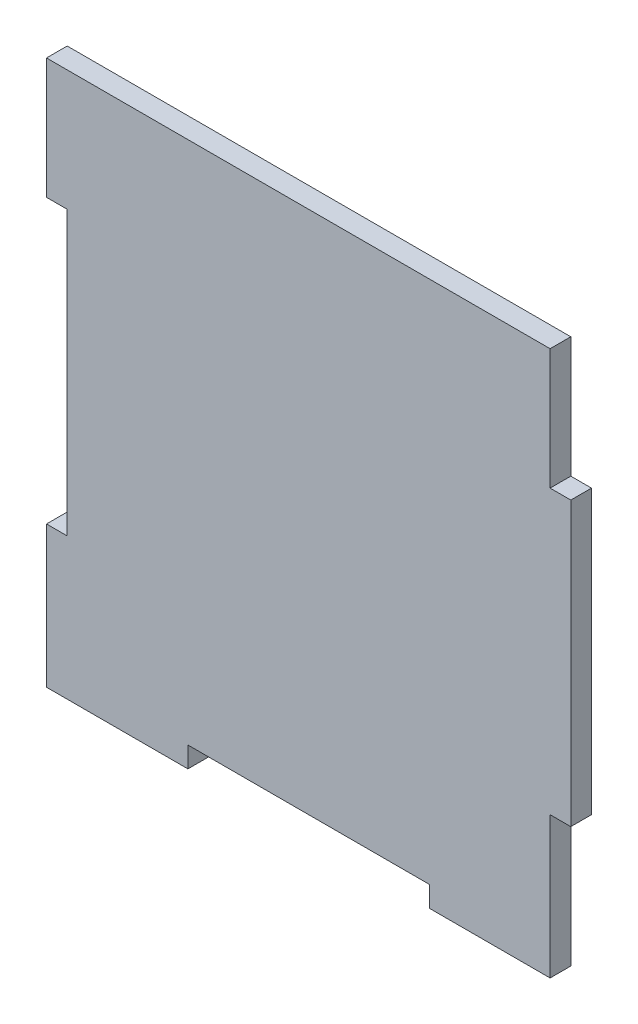
ISO-10303-21;
HEADER;
FILE_DESCRIPTION(('STEP AP214'),'2;1');
FILE_NAME('part.step','',(''),(''),'','','');
FILE_SCHEMA(('AUTOMOTIVE_DESIGN { 1 0 10303 214 1 1 1 1 }'));
ENDSEC;
DATA;
#1=APPLICATION_CONTEXT('core data for automotive mechanical design processes');
#2=APPLICATION_PROTOCOL_DEFINITION('international standard','automotive_design',2000,#1);
#3=PRODUCT_CONTEXT('',#1,'mechanical');
#4=PRODUCT('Part','Part','',(#3));
#5=PRODUCT_RELATED_PRODUCT_CATEGORY('part','',(#4));
#6=PRODUCT_DEFINITION_FORMATION('','',#4);
#7=PRODUCT_DEFINITION_CONTEXT('part definition',#1,'design');
#8=PRODUCT_DEFINITION('design','',#6,#7);
#9=PRODUCT_DEFINITION_SHAPE('','',#8);
#10=(LENGTH_UNIT() NAMED_UNIT(*) SI_UNIT(.MILLI.,.METRE.));
#11=(NAMED_UNIT(*) PLANE_ANGLE_UNIT() SI_UNIT($,.RADIAN.));
#12=(NAMED_UNIT(*) SI_UNIT($,.STERADIAN.) SOLID_ANGLE_UNIT());
#13=UNCERTAINTY_MEASURE_WITH_UNIT(LENGTH_MEASURE(1.E-05),#10,'distance_accuracy_value','');
#14=(GEOMETRIC_REPRESENTATION_CONTEXT(3) GLOBAL_UNCERTAINTY_ASSIGNED_CONTEXT((#13)) GLOBAL_UNIT_ASSIGNED_CONTEXT((#10,
#11,#12)) REPRESENTATION_CONTEXT('',''));
#15=CARTESIAN_POINT('',(0.,0.,0.));
#16=DIRECTION('',(0.,0.,1.));
#17=DIRECTION('',(1.,0.,0.));
#18=AXIS2_PLACEMENT_3D('',#15,#16,#17);
#19=CARTESIAN_POINT('',(35.,-20.5,3.));
#20=DIRECTION('',(0.,1.,0.));
#21=DIRECTION('',(-1.,0.,0.));
#22=AXIS2_PLACEMENT_3D('',#19,#20,#21);
#23=PLANE('',#22);
#24=DIRECTION('',(1.,0.,0.));
#25=VECTOR('',#24,1.);
#26=CARTESIAN_POINT('',(35.,-20.5,0.));
#27=LINE('',#26,#25);
#28=CARTESIAN_POINT('',(35.,-20.5,0.));
#29=VERTEX_POINT('',#28);
#30=CARTESIAN_POINT('',(38.,-20.5,0.));
#31=VERTEX_POINT('',#30);
#32=EDGE_CURVE('E192',#29,#31,#27,.T.);
#33=ORIENTED_EDGE('',*,*,#32,.T.);
#34=DIRECTION('',(0.,0.,-1.));
#35=VECTOR('',#34,1.);
#36=CARTESIAN_POINT('',(38.,-20.5,3.));
#37=LINE('',#36,#35);
#38=CARTESIAN_POINT('',(38.,-20.5,3.));
#39=VERTEX_POINT('',#38);
#40=EDGE_CURVE('E48',#39,#31,#37,.T.);
#41=ORIENTED_EDGE('',*,*,#40,.F.);
#42=DIRECTION('',(1.,0.,0.));
#43=VECTOR('',#42,1.);
#44=CARTESIAN_POINT('',(35.,-20.5,3.));
#45=LINE('',#44,#43);
#46=CARTESIAN_POINT('',(35.,-20.5,3.));
#47=VERTEX_POINT('',#46);
#48=EDGE_CURVE('E124',#47,#39,#45,.T.);
#49=ORIENTED_EDGE('',*,*,#48,.F.);
#50=DIRECTION('',(0.,0.,-1.));
#51=VECTOR('',#50,1.);
#52=CARTESIAN_POINT('',(35.,-20.5,3.));
#53=LINE('',#52,#51);
#54=EDGE_CURVE('E11',#47,#29,#53,.T.);
#55=ORIENTED_EDGE('',*,*,#54,.T.);
#56=EDGE_LOOP('',(#33,#41,#49,#55));
#57=FACE_BOUND('',#56,.T.);
#58=ADVANCED_FACE('F39',(#57),#23,.F.);
#59=CARTESIAN_POINT('',(38.,20.5,3.));
#60=DIRECTION('',(-1.,0.,0.));
#61=DIRECTION('',(0.,0.,1.));
#62=AXIS2_PLACEMENT_3D('',#59,#60,#61);
#63=PLANE('',#62);
#64=DIRECTION('',(0.,1.,0.));
#65=VECTOR('',#64,1.);
#66=CARTESIAN_POINT('',(38.,20.5,0.));
#67=LINE('',#66,#65);
#68=CARTESIAN_POINT('',(38.,20.5,0.));
#69=VERTEX_POINT('',#68);
#70=EDGE_CURVE('E195',#31,#69,#67,.T.);
#71=ORIENTED_EDGE('',*,*,#70,.T.);
#72=DIRECTION('',(0.,0.,-1.));
#73=VECTOR('',#72,1.);
#74=CARTESIAN_POINT('',(38.,20.5,3.));
#75=LINE('',#74,#73);
#76=CARTESIAN_POINT('',(38.,20.5,3.));
#77=VERTEX_POINT('',#76);
#78=EDGE_CURVE('E282',#77,#69,#75,.T.);
#79=ORIENTED_EDGE('',*,*,#78,.F.);
#80=DIRECTION('',(0.,1.,0.));
#81=VECTOR('',#80,1.);
#82=CARTESIAN_POINT('',(38.,20.5,3.));
#83=LINE('',#82,#81);
#84=EDGE_CURVE('E292',#39,#77,#83,.T.);
#85=ORIENTED_EDGE('',*,*,#84,.F.);
#86=ORIENTED_EDGE('',*,*,#40,.T.);
#87=EDGE_LOOP('',(#71,#79,#85,#86));
#88=FACE_BOUND('',#87,.T.);
#89=ADVANCED_FACE('F290',(#88),#63,.F.);
#90=CARTESIAN_POINT('',(35.,20.5,3.));
#91=DIRECTION('',(0.,-1.,0.));
#92=DIRECTION('',(1.,0.,0.));
#93=AXIS2_PLACEMENT_3D('',#90,#91,#92);
#94=PLANE('',#93);
#95=DIRECTION('',(-1.,0.,0.));
#96=VECTOR('',#95,1.);
#97=CARTESIAN_POINT('',(35.,20.5,0.));
#98=LINE('',#97,#96);
#99=CARTESIAN_POINT('',(35.,20.5,0.));
#100=VERTEX_POINT('',#99);
#101=EDGE_CURVE('E198',#69,#100,#98,.T.);
#102=ORIENTED_EDGE('',*,*,#101,.T.);
#103=DIRECTION('',(0.,0.,-1.));
#104=VECTOR('',#103,1.);
#105=CARTESIAN_POINT('',(35.,20.5,3.));
#106=LINE('',#105,#104);
#107=CARTESIAN_POINT('',(35.,20.5,3.));
#108=VERTEX_POINT('',#107);
#109=EDGE_CURVE('E278',#108,#100,#106,.T.);
#110=ORIENTED_EDGE('',*,*,#109,.F.);
#111=DIRECTION('',(-1.,0.,0.));
#112=VECTOR('',#111,1.);
#113=CARTESIAN_POINT('',(35.,20.5,3.));
#114=LINE('',#113,#112);
#115=EDGE_CURVE('E311',#77,#108,#114,.T.);
#116=ORIENTED_EDGE('',*,*,#115,.F.);
#117=ORIENTED_EDGE('',*,*,#78,.T.);
#118=EDGE_LOOP('',(#102,#110,#116,#117));
#119=FACE_BOUND('',#118,.T.);
#120=ADVANCED_FACE('F301',(#119),#94,.F.);
#121=CARTESIAN_POINT('',(35.,38.,3.));
#122=DIRECTION('',(-1.,0.,0.));
#123=DIRECTION('',(0.,-1.,0.));
#124=AXIS2_PLACEMENT_3D('',#121,#122,#123);
#125=PLANE('',#124);
#126=DIRECTION('',(0.,1.,0.));
#127=VECTOR('',#126,1.);
#128=CARTESIAN_POINT('',(35.,38.,0.));
#129=LINE('',#128,#127);
#130=CARTESIAN_POINT('',(35.,38.,0.));
#131=VERTEX_POINT('',#130);
#132=EDGE_CURVE('E201',#100,#131,#129,.T.);
#133=ORIENTED_EDGE('',*,*,#132,.T.);
#134=DIRECTION('',(0.,0.,-1.));
#135=VECTOR('',#134,1.);
#136=CARTESIAN_POINT('',(35.,38.,3.));
#137=LINE('',#136,#135);
#138=CARTESIAN_POINT('',(35.,38.,3.));
#139=VERTEX_POINT('',#138);
#140=EDGE_CURVE('E274',#139,#131,#137,.T.);
#141=ORIENTED_EDGE('',*,*,#140,.F.);
#142=DIRECTION('',(0.,1.,0.));
#143=VECTOR('',#142,1.);
#144=CARTESIAN_POINT('',(35.,38.,3.));
#145=LINE('',#144,#143);
#146=EDGE_CURVE('E307',#108,#139,#145,.T.);
#147=ORIENTED_EDGE('',*,*,#146,.F.);
#148=ORIENTED_EDGE('',*,*,#109,.T.);
#149=EDGE_LOOP('',(#133,#141,#147,#148));
#150=FACE_BOUND('',#149,.T.);
#151=ADVANCED_FACE('F305',(#150),#125,.F.);
#152=CARTESIAN_POINT('',(-38.,38.,3.));
#153=DIRECTION('',(0.,-1.,0.));
#154=DIRECTION('',(0.,0.,-1.));
#155=AXIS2_PLACEMENT_3D('',#152,#153,#154);
#156=PLANE('',#155);
#157=DIRECTION('',(-1.,0.,0.));
#158=VECTOR('',#157,1.);
#159=CARTESIAN_POINT('',(-38.,38.,0.));
#160=LINE('',#159,#158);
#161=CARTESIAN_POINT('',(-38.,38.,0.));
#162=VERTEX_POINT('',#161);
#163=EDGE_CURVE('E205',#131,#162,#160,.T.);
#164=ORIENTED_EDGE('',*,*,#163,.T.);
#165=DIRECTION('',(0.,0.,-1.));
#166=VECTOR('',#165,1.);
#167=CARTESIAN_POINT('',(-38.,38.,3.));
#168=LINE('',#167,#166);
#169=CARTESIAN_POINT('',(-38.,38.,3.));
#170=VERTEX_POINT('',#169);
#171=EDGE_CURVE('E270',#170,#162,#168,.T.);
#172=ORIENTED_EDGE('',*,*,#171,.F.);
#173=DIRECTION('',(-1.,0.,0.));
#174=VECTOR('',#173,1.);
#175=CARTESIAN_POINT('',(17.5,38.,3.));
#176=LINE('',#175,#174);
#177=EDGE_CURVE('E310',#139,#170,#176,.T.);
#178=ORIENTED_EDGE('',*,*,#177,.F.);
#179=ORIENTED_EDGE('',*,*,#140,.T.);
#180=EDGE_LOOP('',(#164,#172,#178,#179));
#181=FACE_BOUND('',#180,.T.);
#182=ADVANCED_FACE('F372',(#181),#156,.F.);
#183=CARTESIAN_POINT('',(-38.,20.5,3.));
#184=DIRECTION('',(1.,0.,0.));
#185=DIRECTION('',(0.,0.,-1.));
#186=AXIS2_PLACEMENT_3D('',#183,#184,#185);
#187=PLANE('',#186);
#188=DIRECTION('',(0.,-1.,0.));
#189=VECTOR('',#188,1.);
#190=CARTESIAN_POINT('',(-38.,20.5,0.));
#191=LINE('',#190,#189);
#192=CARTESIAN_POINT('',(-38.,20.5,0.));
#193=VERTEX_POINT('',#192);
#194=EDGE_CURVE('E208',#162,#193,#191,.T.);
#195=ORIENTED_EDGE('',*,*,#194,.T.);
#196=DIRECTION('',(0.,0.,-1.));
#197=VECTOR('',#196,1.);
#198=CARTESIAN_POINT('',(-38.,20.5,3.));
#199=LINE('',#198,#197);
#200=CARTESIAN_POINT('',(-38.,20.5,3.));
#201=VERTEX_POINT('',#200);
#202=EDGE_CURVE('E266',#201,#193,#199,.T.);
#203=ORIENTED_EDGE('',*,*,#202,.F.);
#204=DIRECTION('',(0.,-1.,0.));
#205=VECTOR('',#204,1.);
#206=CARTESIAN_POINT('',(-38.,20.5,3.));
#207=LINE('',#206,#205);
#208=EDGE_CURVE('E315',#170,#201,#207,.T.);
#209=ORIENTED_EDGE('',*,*,#208,.F.);
#210=ORIENTED_EDGE('',*,*,#171,.T.);
#211=EDGE_LOOP('',(#195,#203,#209,#210));
#212=FACE_BOUND('',#211,.T.);
#213=ADVANCED_FACE('F375',(#212),#187,.F.);
#214=CARTESIAN_POINT('',(-35.,20.5,3.));
#215=DIRECTION('',(0.,1.,0.));
#216=DIRECTION('',(0.,0.,1.));
#217=AXIS2_PLACEMENT_3D('',#214,#215,#216);
#218=PLANE('',#217);
#219=DIRECTION('',(1.,0.,0.));
#220=VECTOR('',#219,1.);
#221=CARTESIAN_POINT('',(-35.,20.5,0.));
#222=LINE('',#221,#220);
#223=CARTESIAN_POINT('',(-35.,20.5,0.));
#224=VERTEX_POINT('',#223);
#225=EDGE_CURVE('E211',#193,#224,#222,.T.);
#226=ORIENTED_EDGE('',*,*,#225,.T.);
#227=DIRECTION('',(0.,0.,-1.));
#228=VECTOR('',#227,1.);
#229=CARTESIAN_POINT('',(-35.,20.5,3.));
#230=LINE('',#229,#228);
#231=CARTESIAN_POINT('',(-35.,20.5,3.));
#232=VERTEX_POINT('',#231);
#233=EDGE_CURVE('E262',#232,#224,#230,.T.);
#234=ORIENTED_EDGE('',*,*,#233,.F.);
#235=DIRECTION('',(1.,0.,0.));
#236=VECTOR('',#235,1.);
#237=CARTESIAN_POINT('',(-35.,20.5,3.));
#238=LINE('',#237,#236);
#239=EDGE_CURVE('E322',#201,#232,#238,.T.);
#240=ORIENTED_EDGE('',*,*,#239,.F.);
#241=ORIENTED_EDGE('',*,*,#202,.T.);
#242=EDGE_LOOP('',(#226,#234,#240,#241));
#243=FACE_BOUND('',#242,.T.);
#244=ADVANCED_FACE('F379',(#243),#218,.F.);
#245=CARTESIAN_POINT('',(-35.,20.5,3.));
#246=DIRECTION('',(1.,0.,0.));
#247=DIRECTION('',(0.,0.,-1.));
#248=AXIS2_PLACEMENT_3D('',#245,#246,#247);
#249=PLANE('',#248);
#250=DIRECTION('',(0.,-1.,0.));
#251=VECTOR('',#250,1.);
#252=CARTESIAN_POINT('',(-35.,20.5,0.));
#253=LINE('',#252,#251);
#254=CARTESIAN_POINT('',(-35.,-20.5,0.));
#255=VERTEX_POINT('',#254);
#256=EDGE_CURVE('E214',#224,#255,#253,.T.);
#257=ORIENTED_EDGE('',*,*,#256,.T.);
#258=DIRECTION('',(0.,0.,-1.));
#259=VECTOR('',#258,1.);
#260=CARTESIAN_POINT('',(-35.,-20.5,3.));
#261=LINE('',#260,#259);
#262=CARTESIAN_POINT('',(-35.,-20.5,3.));
#263=VERTEX_POINT('',#262);
#264=EDGE_CURVE('E258',#263,#255,#261,.T.);
#265=ORIENTED_EDGE('',*,*,#264,.F.);
#266=DIRECTION('',(0.,-1.,0.));
#267=VECTOR('',#266,1.);
#268=CARTESIAN_POINT('',(-35.,20.5,3.));
#269=LINE('',#268,#267);
#270=EDGE_CURVE('E325',#232,#263,#269,.T.);
#271=ORIENTED_EDGE('',*,*,#270,.F.);
#272=ORIENTED_EDGE('',*,*,#233,.T.);
#273=EDGE_LOOP('',(#257,#265,#271,#272));
#274=FACE_BOUND('',#273,.T.);
#275=ADVANCED_FACE('F383',(#274),#249,.F.);
#276=CARTESIAN_POINT('',(-35.,-20.5,3.));
#277=DIRECTION('',(0.,-1.,0.));
#278=DIRECTION('',(0.,0.,-1.));
#279=AXIS2_PLACEMENT_3D('',#276,#277,#278);
#280=PLANE('',#279);
#281=DIRECTION('',(-1.,0.,0.));
#282=VECTOR('',#281,1.);
#283=CARTESIAN_POINT('',(-35.,-20.5,0.));
#284=LINE('',#283,#282);
#285=CARTESIAN_POINT('',(-38.,-20.5,0.));
#286=VERTEX_POINT('',#285);
#287=EDGE_CURVE('E217',#255,#286,#284,.T.);
#288=ORIENTED_EDGE('',*,*,#287,.T.);
#289=DIRECTION('',(0.,0.,-1.));
#290=VECTOR('',#289,1.);
#291=CARTESIAN_POINT('',(-38.,-20.5,3.));
#292=LINE('',#291,#290);
#293=CARTESIAN_POINT('',(-38.,-20.5,3.));
#294=VERTEX_POINT('',#293);
#295=EDGE_CURVE('E254',#294,#286,#292,.T.);
#296=ORIENTED_EDGE('',*,*,#295,.F.);
#297=DIRECTION('',(-1.,0.,0.));
#298=VECTOR('',#297,1.);
#299=CARTESIAN_POINT('',(-35.,-20.5,3.));
#300=LINE('',#299,#298);
#301=EDGE_CURVE('E328',#263,#294,#300,.T.);
#302=ORIENTED_EDGE('',*,*,#301,.F.);
#303=ORIENTED_EDGE('',*,*,#264,.T.);
#304=EDGE_LOOP('',(#288,#296,#302,#303));
#305=FACE_BOUND('',#304,.T.);
#306=ADVANCED_FACE('F387',(#305),#280,.F.);
#307=CARTESIAN_POINT('',(-38.,-38.,3.));
#308=DIRECTION('',(1.,0.,0.));
#309=DIRECTION('',(0.,0.,-1.));
#310=AXIS2_PLACEMENT_3D('',#307,#308,#309);
#311=PLANE('',#310);
#312=DIRECTION('',(0.,-1.,0.));
#313=VECTOR('',#312,1.);
#314=CARTESIAN_POINT('',(-38.,-38.,0.));
#315=LINE('',#314,#313);
#316=CARTESIAN_POINT('',(-38.,-41.,0.));
#317=VERTEX_POINT('',#316);
#318=EDGE_CURVE('E221',#286,#317,#315,.T.);
#319=ORIENTED_EDGE('',*,*,#318,.T.);
#320=DIRECTION('',(0.,0.,-1.));
#321=VECTOR('',#320,1.);
#322=CARTESIAN_POINT('',(-38.,-41.,3.));
#323=LINE('',#322,#321);
#324=CARTESIAN_POINT('',(-38.,-41.,3.));
#325=VERTEX_POINT('',#324);
#326=EDGE_CURVE('E250',#325,#317,#323,.T.);
#327=ORIENTED_EDGE('',*,*,#326,.F.);
#328=DIRECTION('',(0.,-1.,0.));
#329=VECTOR('',#328,1.);
#330=CARTESIAN_POINT('',(-38.,-20.5,3.));
#331=LINE('',#330,#329);
#332=EDGE_CURVE('E331',#294,#325,#331,.T.);
#333=ORIENTED_EDGE('',*,*,#332,.F.);
#334=ORIENTED_EDGE('',*,*,#295,.T.);
#335=EDGE_LOOP('',(#319,#327,#333,#334));
#336=FACE_BOUND('',#335,.T.);
#337=ADVANCED_FACE('F391',(#336),#311,.F.);
#338=CARTESIAN_POINT('',(-35.,-41.,3.));
#339=DIRECTION('',(0.,1.,0.));
#340=DIRECTION('',(0.,0.,1.));
#341=AXIS2_PLACEMENT_3D('',#338,#339,#340);
#342=PLANE('',#341);
#343=DIRECTION('',(1.,0.,0.));
#344=VECTOR('',#343,1.);
#345=CARTESIAN_POINT('',(-35.,-41.,0.));
#346=LINE('',#345,#344);
#347=CARTESIAN_POINT('',(-17.5,-41.,0.));
#348=VERTEX_POINT('',#347);
#349=EDGE_CURVE('E225',#317,#348,#346,.T.);
#350=ORIENTED_EDGE('',*,*,#349,.T.);
#351=DIRECTION('',(0.,0.,-1.));
#352=VECTOR('',#351,1.);
#353=CARTESIAN_POINT('',(-17.5,-41.,3.));
#354=LINE('',#353,#352);
#355=CARTESIAN_POINT('',(-17.5,-41.,3.));
#356=VERTEX_POINT('',#355);
#357=EDGE_CURVE('E246',#356,#348,#354,.T.);
#358=ORIENTED_EDGE('',*,*,#357,.F.);
#359=DIRECTION('',(1.,0.,0.));
#360=VECTOR('',#359,1.);
#361=CARTESIAN_POINT('',(-38.,-41.,3.));
#362=LINE('',#361,#360);
#363=EDGE_CURVE('E334',#325,#356,#362,.T.);
#364=ORIENTED_EDGE('',*,*,#363,.F.);
#365=ORIENTED_EDGE('',*,*,#326,.T.);
#366=EDGE_LOOP('',(#350,#358,#364,#365));
#367=FACE_BOUND('',#366,.T.);
#368=ADVANCED_FACE('F342',(#367),#342,.F.);
#369=CARTESIAN_POINT('',(-17.5,-38.,3.));
#370=DIRECTION('',(-1.,0.,0.));
#371=DIRECTION('',(0.,0.,1.));
#372=AXIS2_PLACEMENT_3D('',#369,#370,#371);
#373=PLANE('',#372);
#374=DIRECTION('',(0.,1.,0.));
#375=VECTOR('',#374,1.);
#376=CARTESIAN_POINT('',(-17.5,-38.,0.));
#377=LINE('',#376,#375);
#378=CARTESIAN_POINT('',(-17.5,-38.,0.));
#379=VERTEX_POINT('',#378);
#380=EDGE_CURVE('E228',#348,#379,#377,.T.);
#381=ORIENTED_EDGE('',*,*,#380,.T.);
#382=DIRECTION('',(0.,0.,-1.));
#383=VECTOR('',#382,1.);
#384=CARTESIAN_POINT('',(-17.5,-38.,3.));
#385=LINE('',#384,#383);
#386=CARTESIAN_POINT('',(-17.5,-38.,3.));
#387=VERTEX_POINT('',#386);
#388=EDGE_CURVE('E179',#387,#379,#385,.T.);
#389=ORIENTED_EDGE('',*,*,#388,.F.);
#390=DIRECTION('',(0.,1.,0.));
#391=VECTOR('',#390,1.);
#392=CARTESIAN_POINT('',(-17.5,-38.,3.));
#393=LINE('',#392,#391);
#394=EDGE_CURVE('E168',#356,#387,#393,.T.);
#395=ORIENTED_EDGE('',*,*,#394,.F.);
#396=ORIENTED_EDGE('',*,*,#357,.T.);
#397=EDGE_LOOP('',(#381,#389,#395,#396));
#398=FACE_BOUND('',#397,.T.);
#399=ADVANCED_FACE('F345',(#398),#373,.F.);
#400=CARTESIAN_POINT('',(-17.5,-38.,3.));
#401=DIRECTION('',(0.,1.,0.));
#402=DIRECTION('',(-1.,0.,0.));
#403=AXIS2_PLACEMENT_3D('',#400,#401,#402);
#404=PLANE('',#403);
#405=DIRECTION('',(1.,0.,0.));
#406=VECTOR('',#405,1.);
#407=CARTESIAN_POINT('',(-17.5,-38.,0.));
#408=LINE('',#407,#406);
#409=CARTESIAN_POINT('',(17.5,-38.,0.));
#410=VERTEX_POINT('',#409);
#411=EDGE_CURVE('E177',#379,#410,#408,.T.);
#412=ORIENTED_EDGE('',*,*,#411,.T.);
#413=DIRECTION('',(0.,0.,-1.));
#414=VECTOR('',#413,1.);
#415=CARTESIAN_POINT('',(17.5,-38.,3.));
#416=LINE('',#415,#414);
#417=CARTESIAN_POINT('',(17.5,-38.,3.));
#418=VERTEX_POINT('',#417);
#419=EDGE_CURVE('E174',#418,#410,#416,.T.);
#420=ORIENTED_EDGE('',*,*,#419,.F.);
#421=DIRECTION('',(1.,0.,0.));
#422=VECTOR('',#421,1.);
#423=CARTESIAN_POINT('',(-17.5,-38.,3.));
#424=LINE('',#423,#422);
#425=EDGE_CURVE('E162',#387,#418,#424,.T.);
#426=ORIENTED_EDGE('',*,*,#425,.F.);
#427=ORIENTED_EDGE('',*,*,#388,.T.);
#428=EDGE_LOOP('',(#412,#420,#426,#427));
#429=FACE_BOUND('',#428,.T.);
#430=ADVANCED_FACE('F175',(#429),#404,.F.);
#431=CARTESIAN_POINT('',(17.5,-41.,3.));
#432=DIRECTION('',(1.,0.,0.));
#433=DIRECTION('',(0.,1.,0.));
#434=AXIS2_PLACEMENT_3D('',#431,#432,#433);
#435=PLANE('',#434);
#436=DIRECTION('',(0.,-1.,0.));
#437=VECTOR('',#436,1.);
#438=CARTESIAN_POINT('',(17.5,-41.,0.));
#439=LINE('',#438,#437);
#440=CARTESIAN_POINT('',(17.5,-41.,0.));
#441=VERTEX_POINT('',#440);
#442=EDGE_CURVE('E110',#410,#441,#439,.T.);
#443=ORIENTED_EDGE('',*,*,#442,.T.);
#444=DIRECTION('',(0.,0.,-1.));
#445=VECTOR('',#444,1.);
#446=CARTESIAN_POINT('',(17.5,-41.,3.));
#447=LINE('',#446,#445);
#448=CARTESIAN_POINT('',(17.5,-41.,3.));
#449=VERTEX_POINT('',#448);
#450=EDGE_CURVE('E180',#449,#441,#447,.T.);
#451=ORIENTED_EDGE('',*,*,#450,.F.);
#452=DIRECTION('',(0.,-1.,0.));
#453=VECTOR('',#452,1.);
#454=CARTESIAN_POINT('',(17.5,-41.,3.));
#455=LINE('',#454,#453);
#456=EDGE_CURVE('E166',#418,#449,#455,.T.);
#457=ORIENTED_EDGE('',*,*,#456,.F.);
#458=ORIENTED_EDGE('',*,*,#419,.T.);
#459=EDGE_LOOP('',(#443,#451,#457,#458));
#460=FACE_BOUND('',#459,.T.);
#461=ADVANCED_FACE('F182',(#460),#435,.F.);
#462=CARTESIAN_POINT('',(35.,-41.,3.));
#463=DIRECTION('',(0.,1.,0.));
#464=DIRECTION('',(-1.,0.,0.));
#465=AXIS2_PLACEMENT_3D('',#462,#463,#464);
#466=PLANE('',#465);
#467=DIRECTION('',(1.,0.,0.));
#468=VECTOR('',#467,1.);
#469=CARTESIAN_POINT('',(35.,-41.,0.));
#470=LINE('',#469,#468);
#471=CARTESIAN_POINT('',(35.,-41.,0.));
#472=VERTEX_POINT('',#471);
#473=EDGE_CURVE('E117',#441,#472,#470,.T.);
#474=ORIENTED_EDGE('',*,*,#473,.T.);
#475=DIRECTION('',(0.,0.,-1.));
#476=VECTOR('',#475,1.);
#477=CARTESIAN_POINT('',(35.,-41.,3.));
#478=LINE('',#477,#476);
#479=CARTESIAN_POINT('',(35.,-41.,3.));
#480=VERTEX_POINT('',#479);
#481=EDGE_CURVE('E188',#480,#472,#478,.T.);
#482=ORIENTED_EDGE('',*,*,#481,.F.);
#483=DIRECTION('',(1.,0.,0.));
#484=VECTOR('',#483,1.);
#485=CARTESIAN_POINT('',(35.,-41.,3.));
#486=LINE('',#485,#484);
#487=EDGE_CURVE('E185',#449,#480,#486,.T.);
#488=ORIENTED_EDGE('',*,*,#487,.F.);
#489=ORIENTED_EDGE('',*,*,#450,.T.);
#490=EDGE_LOOP('',(#474,#482,#488,#489));
#491=FACE_BOUND('',#490,.T.);
#492=ADVANCED_FACE('F347',(#491),#466,.F.);
#493=CARTESIAN_POINT('',(35.,-38.,3.));
#494=DIRECTION('',(-1.,0.,0.));
#495=DIRECTION('',(0.,-1.,0.));
#496=AXIS2_PLACEMENT_3D('',#493,#494,#495);
#497=PLANE('',#496);
#498=DIRECTION('',(0.,1.,0.));
#499=VECTOR('',#498,1.);
#500=CARTESIAN_POINT('',(35.,-38.,0.));
#501=LINE('',#500,#499);
#502=EDGE_CURVE('E237',#472,#29,#501,.T.);
#503=ORIENTED_EDGE('',*,*,#502,.T.);
#504=ORIENTED_EDGE('',*,*,#54,.F.);
#505=DIRECTION('',(0.,1.,0.));
#506=VECTOR('',#505,1.);
#507=CARTESIAN_POINT('',(35.,-20.5,3.));
#508=LINE('',#507,#506);
#509=EDGE_CURVE('E56',#480,#47,#508,.T.);
#510=ORIENTED_EDGE('',*,*,#509,.F.);
#511=ORIENTED_EDGE('',*,*,#481,.T.);
#512=EDGE_LOOP('',(#503,#504,#510,#511));
#513=FACE_BOUND('',#512,.T.);
#514=ADVANCED_FACE('F346',(#513),#497,.F.);
#515=CARTESIAN_POINT('',(0.,0.,3.));
#516=DIRECTION('',(0.,0.,-1.));
#517=DIRECTION('',(-1.,0.,0.));
#518=AXIS2_PLACEMENT_3D('',#515,#516,#517);
#519=PLANE('',#518);
#520=ORIENTED_EDGE('',*,*,#509,.T.);
#521=ORIENTED_EDGE('',*,*,#48,.T.);
#522=ORIENTED_EDGE('',*,*,#84,.T.);
#523=ORIENTED_EDGE('',*,*,#115,.T.);
#524=ORIENTED_EDGE('',*,*,#146,.T.);
#525=ORIENTED_EDGE('',*,*,#177,.T.);
#526=ORIENTED_EDGE('',*,*,#208,.T.);
#527=ORIENTED_EDGE('',*,*,#239,.T.);
#528=ORIENTED_EDGE('',*,*,#270,.T.);
#529=ORIENTED_EDGE('',*,*,#301,.T.);
#530=ORIENTED_EDGE('',*,*,#332,.T.);
#531=ORIENTED_EDGE('',*,*,#363,.T.);
#532=ORIENTED_EDGE('',*,*,#394,.T.);
#533=ORIENTED_EDGE('',*,*,#425,.T.);
#534=ORIENTED_EDGE('',*,*,#456,.T.);
#535=ORIENTED_EDGE('',*,*,#487,.T.);
#536=EDGE_LOOP('',(#520,#521,#522,#523,#524,#525,#526,#527,#528,#529,#530,#531,#532,#533,#534,#535));
#537=FACE_BOUND('',#536,.T.);
#538=ADVANCED_FACE('F164',(#537),#519,.F.);
#539=CARTESIAN_POINT('',(0.,0.,0.));
#540=DIRECTION('',(0.,0.,-1.));
#541=DIRECTION('',(-1.,0.,0.));
#542=AXIS2_PLACEMENT_3D('',#539,#540,#541);
#543=PLANE('',#542);
#544=ORIENTED_EDGE('',*,*,#32,.F.);
#545=ORIENTED_EDGE('',*,*,#502,.F.);
#546=ORIENTED_EDGE('',*,*,#473,.F.);
#547=ORIENTED_EDGE('',*,*,#442,.F.);
#548=ORIENTED_EDGE('',*,*,#411,.F.);
#549=ORIENTED_EDGE('',*,*,#380,.F.);
#550=ORIENTED_EDGE('',*,*,#349,.F.);
#551=ORIENTED_EDGE('',*,*,#318,.F.);
#552=ORIENTED_EDGE('',*,*,#287,.F.);
#553=ORIENTED_EDGE('',*,*,#256,.F.);
#554=ORIENTED_EDGE('',*,*,#225,.F.);
#555=ORIENTED_EDGE('',*,*,#194,.F.);
#556=ORIENTED_EDGE('',*,*,#163,.F.);
#557=ORIENTED_EDGE('',*,*,#132,.F.);
#558=ORIENTED_EDGE('',*,*,#101,.F.);
#559=ORIENTED_EDGE('',*,*,#70,.F.);
#560=EDGE_LOOP('',(#544,#545,#546,#547,#548,#549,#550,#551,#552,#553,#554,#555,#556,#557,#558,#559));
#561=FACE_BOUND('',#560,.T.);
#562=ADVANCED_FACE('F296',(#561),#543,.T.);
#563=CLOSED_SHELL('',(#58,#89,#120,#151,#182,#213,#244,#275,#306,#337,#368,#399,#430,#461,#492,
#514,#538,#562));
#564=MANIFOLD_SOLID_BREP('B2',#563);
#565=ADVANCED_BREP_SHAPE_REPRESENTATION('',(#18,#564),#14);
#566=SHAPE_DEFINITION_REPRESENTATION(#9,#565);
ENDSEC;
END-ISO-10303-21;
